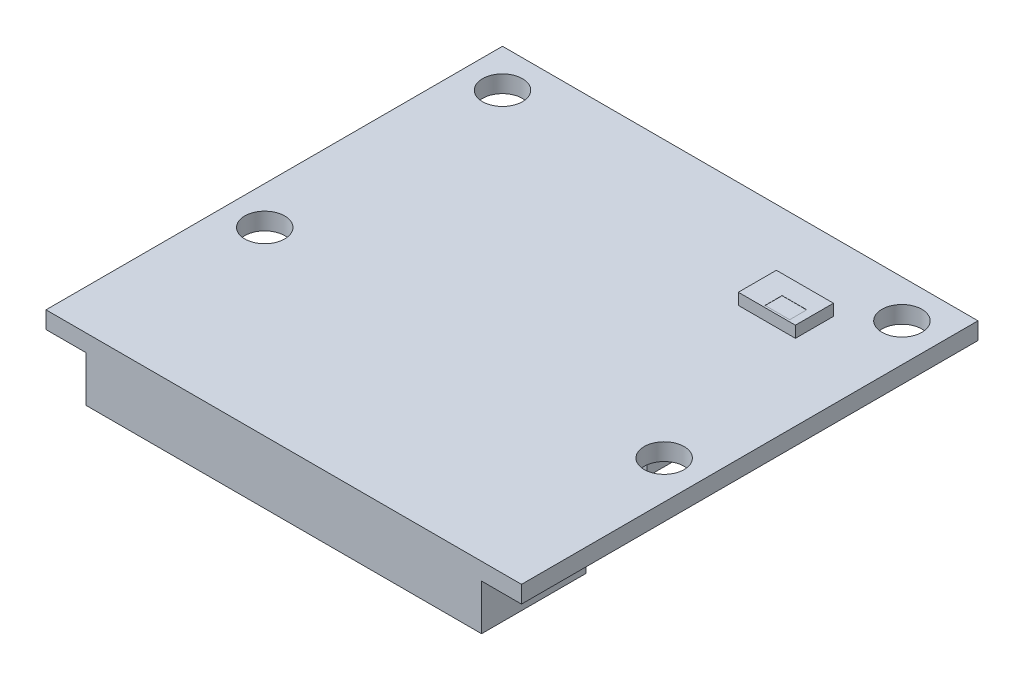
ISO-10303-21;
HEADER;
FILE_DESCRIPTION(('STEP AP214'),'2;1');
FILE_NAME('part.step','',(''),(''),'','','');
FILE_SCHEMA(('AUTOMOTIVE_DESIGN { 1 0 10303 214 1 1 1 1 }'));
ENDSEC;
DATA;
#1=APPLICATION_CONTEXT('core data for automotive mechanical design processes');
#2=APPLICATION_PROTOCOL_DEFINITION('international standard','automotive_design',2000,#1);
#3=PRODUCT_CONTEXT('',#1,'mechanical');
#4=PRODUCT('Part','Part','',(#3));
#5=PRODUCT_RELATED_PRODUCT_CATEGORY('part','',(#4));
#6=PRODUCT_DEFINITION_FORMATION('','',#4);
#7=PRODUCT_DEFINITION_CONTEXT('part definition',#1,'design');
#8=PRODUCT_DEFINITION('design','',#6,#7);
#9=PRODUCT_DEFINITION_SHAPE('','',#8);
#10=(LENGTH_UNIT() NAMED_UNIT(*) SI_UNIT(.MILLI.,.METRE.));
#11=(NAMED_UNIT(*) PLANE_ANGLE_UNIT() SI_UNIT($,.RADIAN.));
#12=(NAMED_UNIT(*) SI_UNIT($,.STERADIAN.) SOLID_ANGLE_UNIT());
#13=UNCERTAINTY_MEASURE_WITH_UNIT(LENGTH_MEASURE(1.E-05),#10,'distance_accuracy_value','');
#14=(GEOMETRIC_REPRESENTATION_CONTEXT(3) GLOBAL_UNCERTAINTY_ASSIGNED_CONTEXT((#13)) GLOBAL_UNIT_ASSIGNED_CONTEXT((#10,
#11,#12)) REPRESENTATION_CONTEXT('',''));
#15=CARTESIAN_POINT('',(0.,0.,0.));
#16=DIRECTION('',(0.,0.,1.));
#17=DIRECTION('',(1.,0.,0.));
#18=AXIS2_PLACEMENT_3D('',#15,#16,#17);
#19=CARTESIAN_POINT('',(0.,0.,0.));
#20=DIRECTION('',(0.,1.,0.));
#21=DIRECTION('',(0.,0.,1.));
#22=AXIS2_PLACEMENT_3D('',#19,#20,#21);
#23=PLANE('',#22);
#24=DIRECTION('',(0.,0.,1.));
#25=VECTOR('',#24,1.);
#26=CARTESIAN_POINT('',(-12.5,0.,-14.5));
#27=LINE('',#26,#25);
#28=CARTESIAN_POINT('',(-12.5,0.,-14.5));
#29=VERTEX_POINT('',#28);
#30=CARTESIAN_POINT('',(-12.5,0.,9.5));
#31=VERTEX_POINT('',#30);
#32=EDGE_CURVE('E327',#29,#31,#27,.T.);
#33=ORIENTED_EDGE('',*,*,#32,.T.);
#34=DIRECTION('',(1.,0.,0.));
#35=VECTOR('',#34,1.);
#36=CARTESIAN_POINT('',(-12.5,0.,9.5));
#37=LINE('',#36,#35);
#38=CARTESIAN_POINT('',(12.5,0.,9.5));
#39=VERTEX_POINT('',#38);
#40=EDGE_CURVE('E330',#31,#39,#37,.T.);
#41=ORIENTED_EDGE('',*,*,#40,.T.);
#42=DIRECTION('',(0.,0.,-1.));
#43=VECTOR('',#42,1.);
#44=CARTESIAN_POINT('',(12.5,0.,-14.5));
#45=LINE('',#44,#43);
#46=CARTESIAN_POINT('',(12.5,0.,-14.5));
#47=VERTEX_POINT('',#46);
#48=EDGE_CURVE('E334',#39,#47,#45,.T.);
#49=ORIENTED_EDGE('',*,*,#48,.T.);
#50=DIRECTION('',(-1.,0.,0.));
#51=VECTOR('',#50,1.);
#52=CARTESIAN_POINT('',(-12.5,0.,-14.5));
#53=LINE('',#52,#51);
#54=EDGE_CURVE('E337',#47,#29,#53,.T.);
#55=ORIENTED_EDGE('',*,*,#54,.T.);
#56=EDGE_LOOP('',(#33,#41,#49,#55));
#57=FACE_BOUND('',#56,.T.);
#58=CARTESIAN_POINT('',(10.5,0.,-12.5));
#59=DIRECTION('',(0.,1.,0.));
#60=DIRECTION('',(0.,0.,1.));
#61=AXIS2_PLACEMENT_3D('',#58,#59,#60);
#62=CIRCLE('',#61,1.05);
#63=CARTESIAN_POINT('',(10.5,0.,-11.45));
#64=VERTEX_POINT('',#63);
#65=EDGE_CURVE('E390',#64,#64,#62,.T.);
#66=ORIENTED_EDGE('',*,*,#65,.F.);
#67=EDGE_LOOP('',(#66));
#68=FACE_BOUND('',#67,.T.);
#69=CARTESIAN_POINT('',(10.5,0.,0.));
#70=DIRECTION('',(0.,1.,0.));
#71=DIRECTION('',(0.,0.,1.));
#72=AXIS2_PLACEMENT_3D('',#69,#70,#71);
#73=CIRCLE('',#72,1.05);
#74=CARTESIAN_POINT('',(10.5,0.,1.05));
#75=VERTEX_POINT('',#74);
#76=EDGE_CURVE('E384',#75,#75,#73,.T.);
#77=ORIENTED_EDGE('',*,*,#76,.F.);
#78=EDGE_LOOP('',(#77));
#79=FACE_BOUND('',#78,.T.);
#80=CARTESIAN_POINT('',(-10.5,0.,0.));
#81=DIRECTION('',(0.,1.,0.));
#82=DIRECTION('',(0.,0.,-1.));
#83=AXIS2_PLACEMENT_3D('',#80,#81,#82);
#84=CIRCLE('',#83,1.05);
#85=CARTESIAN_POINT('',(-10.5,0.,-1.05));
#86=VERTEX_POINT('',#85);
#87=EDGE_CURVE('E379',#86,#86,#84,.T.);
#88=ORIENTED_EDGE('',*,*,#87,.F.);
#89=EDGE_LOOP('',(#88));
#90=FACE_BOUND('',#89,.T.);
#91=CARTESIAN_POINT('',(-10.5,0.,-12.5));
#92=DIRECTION('',(0.,1.,0.));
#93=DIRECTION('',(0.,0.,-1.));
#94=AXIS2_PLACEMENT_3D('',#91,#92,#93);
#95=CIRCLE('',#94,1.05);
#96=CARTESIAN_POINT('',(-10.5,0.,-13.55));
#97=VERTEX_POINT('',#96);
#98=EDGE_CURVE('E373',#97,#97,#95,.T.);
#99=ORIENTED_EDGE('',*,*,#98,.F.);
#100=EDGE_LOOP('',(#99));
#101=FACE_BOUND('',#100,.T.);
#102=DIRECTION('',(1.,0.,0.));
#103=VECTOR('',#102,1.);
#104=CARTESIAN_POINT('',(5.5,0.,-8.90000000000001));
#105=LINE('',#104,#103);
#106=CARTESIAN_POINT('',(5.5,0.,-8.90000000000001));
#107=VERTEX_POINT('',#106);
#108=CARTESIAN_POINT('',(8.5,0.,-8.90000000000001));
#109=VERTEX_POINT('',#108);
#110=EDGE_CURVE('E223',#107,#109,#105,.T.);
#111=ORIENTED_EDGE('',*,*,#110,.F.);
#112=DIRECTION('',(0.,0.,1.));
#113=VECTOR('',#112,1.);
#114=CARTESIAN_POINT('',(5.5,0.,-10.9));
#115=LINE('',#114,#113);
#116=CARTESIAN_POINT('',(5.5,0.,-10.9));
#117=VERTEX_POINT('',#116);
#118=EDGE_CURVE('E206',#117,#107,#115,.T.);
#119=ORIENTED_EDGE('',*,*,#118,.F.);
#120=DIRECTION('',(-1.,0.,0.));
#121=VECTOR('',#120,1.);
#122=CARTESIAN_POINT('',(5.5,0.,-10.9));
#123=LINE('',#122,#121);
#124=CARTESIAN_POINT('',(8.5,0.,-10.9));
#125=VERTEX_POINT('',#124);
#126=EDGE_CURVE('E214',#125,#117,#123,.T.);
#127=ORIENTED_EDGE('',*,*,#126,.F.);
#128=DIRECTION('',(0.,0.,-1.));
#129=VECTOR('',#128,1.);
#130=CARTESIAN_POINT('',(8.5,0.,-10.9));
#131=LINE('',#130,#129);
#132=EDGE_CURVE('E225',#109,#125,#131,.T.);
#133=ORIENTED_EDGE('',*,*,#132,.F.);
#134=EDGE_LOOP('',(#111,#119,#127,#133));
#135=FACE_BOUND('',#134,.T.);
#136=ADVANCED_FACE('F32',(#57,#68,#79,#90,#101,#135),#23,.T.);
#137=CARTESIAN_POINT('',(0.,-0.9,0.));
#138=DIRECTION('',(0.,1.,0.));
#139=DIRECTION('',(0.,0.,1.));
#140=AXIS2_PLACEMENT_3D('',#137,#138,#139);
#141=PLANE('',#140);
#142=DIRECTION('',(0.,0.,-1.));
#143=VECTOR('',#142,1.);
#144=CARTESIAN_POINT('',(-10.4,-0.9,9.5));
#145=LINE('',#144,#143);
#146=CARTESIAN_POINT('',(-10.4,-0.9,9.5));
#147=VERTEX_POINT('',#146);
#148=CARTESIAN_POINT('',(-10.4,-0.9,4.));
#149=VERTEX_POINT('',#148);
#150=EDGE_CURVE('E269',#147,#149,#145,.T.);
#151=ORIENTED_EDGE('',*,*,#150,.F.);
#152=DIRECTION('',(1.,0.,0.));
#153=VECTOR('',#152,1.);
#154=CARTESIAN_POINT('',(-12.5,-0.9,9.5));
#155=LINE('',#154,#153);
#156=CARTESIAN_POINT('',(-12.5,-0.9,9.5));
#157=VERTEX_POINT('',#156);
#158=EDGE_CURVE('E312',#157,#147,#155,.T.);
#159=ORIENTED_EDGE('',*,*,#158,.F.);
#160=DIRECTION('',(0.,0.,1.));
#161=VECTOR('',#160,1.);
#162=CARTESIAN_POINT('',(-12.5,-0.9,-14.5));
#163=LINE('',#162,#161);
#164=CARTESIAN_POINT('',(-12.5,-0.9,-14.5));
#165=VERTEX_POINT('',#164);
#166=EDGE_CURVE('E313',#165,#157,#163,.T.);
#167=ORIENTED_EDGE('',*,*,#166,.F.);
#168=DIRECTION('',(-1.,0.,0.));
#169=VECTOR('',#168,1.);
#170=CARTESIAN_POINT('',(-12.5,-0.9,-14.5));
#171=LINE('',#170,#169);
#172=CARTESIAN_POINT('',(12.5,-0.9,-14.5));
#173=VERTEX_POINT('',#172);
#174=EDGE_CURVE('E323',#173,#165,#171,.T.);
#175=ORIENTED_EDGE('',*,*,#174,.F.);
#176=DIRECTION('',(0.,0.,-1.));
#177=VECTOR('',#176,1.);
#178=CARTESIAN_POINT('',(12.5,-0.9,-14.5));
#179=LINE('',#178,#177);
#180=CARTESIAN_POINT('',(12.5,-0.9,9.5));
#181=VERTEX_POINT('',#180);
#182=EDGE_CURVE('E319',#181,#173,#179,.T.);
#183=ORIENTED_EDGE('',*,*,#182,.F.);
#184=CARTESIAN_POINT('',(10.4,-0.9,9.5));
#185=VERTEX_POINT('',#184);
#186=EDGE_CURVE('E309',#185,#181,#155,.T.);
#187=ORIENTED_EDGE('',*,*,#186,.F.);
#188=DIRECTION('',(0.,0.,1.));
#189=VECTOR('',#188,1.);
#190=CARTESIAN_POINT('',(10.4,-0.9,9.5));
#191=LINE('',#190,#189);
#192=CARTESIAN_POINT('',(10.4,-0.9,4.));
#193=VERTEX_POINT('',#192);
#194=EDGE_CURVE('E274',#193,#185,#191,.T.);
#195=ORIENTED_EDGE('',*,*,#194,.F.);
#196=DIRECTION('',(1.,0.,0.));
#197=VECTOR('',#196,1.);
#198=CARTESIAN_POINT('',(-10.4,-0.9,4.));
#199=LINE('',#198,#197);
#200=EDGE_CURVE('E281',#149,#193,#199,.T.);
#201=ORIENTED_EDGE('',*,*,#200,.F.);
#202=EDGE_LOOP('',(#151,#159,#167,#175,#183,#187,#195,#201));
#203=FACE_BOUND('',#202,.T.);
#204=CARTESIAN_POINT('',(-10.5,-0.9,-12.5));
#205=DIRECTION('',(0.,1.,0.));
#206=DIRECTION('',(0.,0.,-1.));
#207=AXIS2_PLACEMENT_3D('',#204,#205,#206);
#208=CIRCLE('',#207,1.05);
#209=CARTESIAN_POINT('',(-10.5,-0.9,-13.55));
#210=VERTEX_POINT('',#209);
#211=EDGE_CURVE('E375',#210,#210,#208,.T.);
#212=ORIENTED_EDGE('',*,*,#211,.T.);
#213=EDGE_LOOP('',(#212));
#214=FACE_BOUND('',#213,.T.);
#215=CARTESIAN_POINT('',(-10.5,-0.9,0.));
#216=DIRECTION('',(0.,1.,0.));
#217=DIRECTION('',(0.,0.,-1.));
#218=AXIS2_PLACEMENT_3D('',#215,#216,#217);
#219=CIRCLE('',#218,1.05);
#220=CARTESIAN_POINT('',(-10.5,-0.9,-1.05));
#221=VERTEX_POINT('',#220);
#222=EDGE_CURVE('E381',#221,#221,#219,.T.);
#223=ORIENTED_EDGE('',*,*,#222,.T.);
#224=EDGE_LOOP('',(#223));
#225=FACE_BOUND('',#224,.T.);
#226=CARTESIAN_POINT('',(10.5,-0.9,0.));
#227=DIRECTION('',(0.,1.,0.));
#228=DIRECTION('',(0.,0.,1.));
#229=AXIS2_PLACEMENT_3D('',#226,#227,#228);
#230=CIRCLE('',#229,1.05);
#231=CARTESIAN_POINT('',(10.5,-0.9,1.05));
#232=VERTEX_POINT('',#231);
#233=EDGE_CURVE('E387',#232,#232,#230,.T.);
#234=ORIENTED_EDGE('',*,*,#233,.T.);
#235=EDGE_LOOP('',(#234));
#236=FACE_BOUND('',#235,.T.);
#237=CARTESIAN_POINT('',(10.5,-0.9,-12.5));
#238=DIRECTION('',(0.,1.,0.));
#239=DIRECTION('',(0.,0.,1.));
#240=AXIS2_PLACEMENT_3D('',#237,#238,#239);
#241=CIRCLE('',#240,1.05);
#242=CARTESIAN_POINT('',(10.5,-0.9,-11.45));
#243=VERTEX_POINT('',#242);
#244=EDGE_CURVE('E331',#243,#243,#241,.T.);
#245=ORIENTED_EDGE('',*,*,#244,.T.);
#246=EDGE_LOOP('',(#245));
#247=FACE_BOUND('',#246,.T.);
#248=DIRECTION('',(0.,0.,-1.));
#249=VECTOR('',#248,1.);
#250=CARTESIAN_POINT('',(-9.,-0.9,-0.900000000000005));
#251=LINE('',#250,#249);
#252=CARTESIAN_POINT('',(-9.,-0.9,-0.900000000000005));
#253=VERTEX_POINT('',#252);
#254=CARTESIAN_POINT('',(-9.,-0.9,-12.5));
#255=VERTEX_POINT('',#254);
#256=EDGE_CURVE('E236',#253,#255,#251,.T.);
#257=ORIENTED_EDGE('',*,*,#256,.F.);
#258=DIRECTION('',(-1.,0.,0.));
#259=VECTOR('',#258,1.);
#260=CARTESIAN_POINT('',(-9.,-0.9,-0.900000000000005));
#261=LINE('',#260,#259);
#262=CARTESIAN_POINT('',(8.7,-0.9,-0.900000000000005));
#263=VERTEX_POINT('',#262);
#264=EDGE_CURVE('E241',#263,#253,#261,.T.);
#265=ORIENTED_EDGE('',*,*,#264,.F.);
#266=DIRECTION('',(0.,0.,1.));
#267=VECTOR('',#266,1.);
#268=CARTESIAN_POINT('',(8.7,-0.9,-0.900000000000005));
#269=LINE('',#268,#267);
#270=CARTESIAN_POINT('',(8.7,-0.9,-12.5));
#271=VERTEX_POINT('',#270);
#272=EDGE_CURVE('E253',#271,#263,#269,.T.);
#273=ORIENTED_EDGE('',*,*,#272,.F.);
#274=DIRECTION('',(1.,0.,0.));
#275=VECTOR('',#274,1.);
#276=CARTESIAN_POINT('',(-9.,-0.9,-12.5));
#277=LINE('',#276,#275);
#278=EDGE_CURVE('E250',#255,#271,#277,.T.);
#279=ORIENTED_EDGE('',*,*,#278,.F.);
#280=EDGE_LOOP('',(#257,#265,#273,#279));
#281=FACE_BOUND('',#280,.T.);
#282=ADVANCED_FACE('F359',(#203,#214,#225,#236,#247,#281),#141,.F.);
#283=CARTESIAN_POINT('',(-12.5,-0.9,-14.5));
#284=DIRECTION('',(-1.,0.,0.));
#285=DIRECTION('',(0.,0.,1.));
#286=AXIS2_PLACEMENT_3D('',#283,#284,#285);
#287=PLANE('',#286);
#288=ORIENTED_EDGE('',*,*,#32,.F.);
#289=DIRECTION('',(0.,1.,0.));
#290=VECTOR('',#289,1.);
#291=CARTESIAN_POINT('',(-12.5,-0.9,-14.5));
#292=LINE('',#291,#290);
#293=EDGE_CURVE('E11',#165,#29,#292,.T.);
#294=ORIENTED_EDGE('',*,*,#293,.F.);
#295=ORIENTED_EDGE('',*,*,#166,.T.);
#296=DIRECTION('',(0.,1.,0.));
#297=VECTOR('',#296,1.);
#298=CARTESIAN_POINT('',(-12.5,-0.9,9.5));
#299=LINE('',#298,#297);
#300=EDGE_CURVE('E326',#157,#31,#299,.T.);
#301=ORIENTED_EDGE('',*,*,#300,.T.);
#302=EDGE_LOOP('',(#288,#294,#295,#301));
#303=FACE_BOUND('',#302,.T.);
#304=ADVANCED_FACE('F34',(#303),#287,.T.);
#305=CARTESIAN_POINT('',(-12.5,-0.9,-14.5));
#306=DIRECTION('',(0.,0.,-1.));
#307=DIRECTION('',(-1.,0.,0.));
#308=AXIS2_PLACEMENT_3D('',#305,#306,#307);
#309=PLANE('',#308);
#310=ORIENTED_EDGE('',*,*,#54,.F.);
#311=DIRECTION('',(0.,1.,0.));
#312=VECTOR('',#311,1.);
#313=CARTESIAN_POINT('',(12.5,-0.9,-14.5));
#314=LINE('',#313,#312);
#315=EDGE_CURVE('E41',#173,#47,#314,.T.);
#316=ORIENTED_EDGE('',*,*,#315,.F.);
#317=ORIENTED_EDGE('',*,*,#174,.T.);
#318=ORIENTED_EDGE('',*,*,#293,.T.);
#319=EDGE_LOOP('',(#310,#316,#317,#318));
#320=FACE_BOUND('',#319,.T.);
#321=ADVANCED_FACE('F356',(#320),#309,.T.);
#322=CARTESIAN_POINT('',(12.5,-0.9,-14.5));
#323=DIRECTION('',(1.,0.,0.));
#324=DIRECTION('',(0.,0.,-1.));
#325=AXIS2_PLACEMENT_3D('',#322,#323,#324);
#326=PLANE('',#325);
#327=ORIENTED_EDGE('',*,*,#48,.F.);
#328=DIRECTION('',(0.,1.,0.));
#329=VECTOR('',#328,1.);
#330=CARTESIAN_POINT('',(12.5,-0.9,9.5));
#331=LINE('',#330,#329);
#332=EDGE_CURVE('E341',#181,#39,#331,.T.);
#333=ORIENTED_EDGE('',*,*,#332,.F.);
#334=ORIENTED_EDGE('',*,*,#182,.T.);
#335=ORIENTED_EDGE('',*,*,#315,.T.);
#336=EDGE_LOOP('',(#327,#333,#334,#335));
#337=FACE_BOUND('',#336,.T.);
#338=ADVANCED_FACE('F487',(#337),#326,.T.);
#339=CARTESIAN_POINT('',(-12.5,-0.9,9.5));
#340=DIRECTION('',(0.,0.,1.));
#341=DIRECTION('',(1.,0.,0.));
#342=AXIS2_PLACEMENT_3D('',#339,#340,#341);
#343=PLANE('',#342);
#344=ORIENTED_EDGE('',*,*,#40,.F.);
#345=ORIENTED_EDGE('',*,*,#300,.F.);
#346=ORIENTED_EDGE('',*,*,#158,.T.);
#347=DIRECTION('',(0.,1.,0.));
#348=VECTOR('',#347,1.);
#349=CARTESIAN_POINT('',(-10.4,-3.3,9.5));
#350=LINE('',#349,#348);
#351=CARTESIAN_POINT('',(-10.4,-3.3,9.5));
#352=VERTEX_POINT('',#351);
#353=EDGE_CURVE('E280',#352,#147,#350,.T.);
#354=ORIENTED_EDGE('',*,*,#353,.F.);
#355=DIRECTION('',(-1.,0.,0.));
#356=VECTOR('',#355,1.);
#357=CARTESIAN_POINT('',(-10.4,-3.3,9.5));
#358=LINE('',#357,#356);
#359=CARTESIAN_POINT('',(10.4,-3.3,9.5));
#360=VERTEX_POINT('',#359);
#361=EDGE_CURVE('E278',#360,#352,#358,.T.);
#362=ORIENTED_EDGE('',*,*,#361,.F.);
#363=DIRECTION('',(0.,1.,0.));
#364=VECTOR('',#363,1.);
#365=CARTESIAN_POINT('',(10.4,-3.3,9.5));
#366=LINE('',#365,#364);
#367=EDGE_CURVE('E293',#360,#185,#366,.T.);
#368=ORIENTED_EDGE('',*,*,#367,.T.);
#369=ORIENTED_EDGE('',*,*,#186,.T.);
#370=ORIENTED_EDGE('',*,*,#332,.T.);
#371=EDGE_LOOP('',(#344,#345,#346,#354,#362,#368,#369,#370));
#372=FACE_BOUND('',#371,.T.);
#373=ADVANCED_FACE('F349',(#372),#343,.T.);
#374=CARTESIAN_POINT('',(10.5,-0.9,-12.5));
#375=DIRECTION('',(0.,1.,0.));
#376=DIRECTION('',(0.,0.,1.));
#377=AXIS2_PLACEMENT_3D('',#374,#375,#376);
#378=CYLINDRICAL_SURFACE('',#377,1.05);
#379=ORIENTED_EDGE('',*,*,#244,.F.);
#380=EDGE_LOOP('',(#379));
#381=FACE_BOUND('',#380,.T.);
#382=ORIENTED_EDGE('',*,*,#65,.T.);
#383=EDGE_LOOP('',(#382));
#384=FACE_BOUND('',#383,.T.);
#385=ADVANCED_FACE('F397',(#381,#384),#378,.F.);
#386=CARTESIAN_POINT('',(10.5,-0.9,0.));
#387=DIRECTION('',(0.,1.,0.));
#388=DIRECTION('',(0.,0.,1.));
#389=AXIS2_PLACEMENT_3D('',#386,#387,#388);
#390=CYLINDRICAL_SURFACE('',#389,1.05);
#391=ORIENTED_EDGE('',*,*,#233,.F.);
#392=EDGE_LOOP('',(#391));
#393=FACE_BOUND('',#392,.T.);
#394=ORIENTED_EDGE('',*,*,#76,.T.);
#395=EDGE_LOOP('',(#394));
#396=FACE_BOUND('',#395,.T.);
#397=ADVANCED_FACE('F475',(#393,#396),#390,.F.);
#398=CARTESIAN_POINT('',(-10.5,-0.9,0.));
#399=DIRECTION('',(0.,1.,0.));
#400=DIRECTION('',(0.,0.,1.));
#401=AXIS2_PLACEMENT_3D('',#398,#399,#400);
#402=CYLINDRICAL_SURFACE('',#401,1.05);
#403=ORIENTED_EDGE('',*,*,#222,.F.);
#404=EDGE_LOOP('',(#403));
#405=FACE_BOUND('',#404,.T.);
#406=ORIENTED_EDGE('',*,*,#87,.T.);
#407=EDGE_LOOP('',(#406));
#408=FACE_BOUND('',#407,.T.);
#409=ADVANCED_FACE('F471',(#405,#408),#402,.F.);
#410=CARTESIAN_POINT('',(-10.5,-0.9,-12.5));
#411=DIRECTION('',(0.,1.,0.));
#412=DIRECTION('',(0.,0.,1.));
#413=AXIS2_PLACEMENT_3D('',#410,#411,#412);
#414=CYLINDRICAL_SURFACE('',#413,1.05);
#415=ORIENTED_EDGE('',*,*,#211,.F.);
#416=EDGE_LOOP('',(#415));
#417=FACE_BOUND('',#416,.T.);
#418=ORIENTED_EDGE('',*,*,#98,.T.);
#419=EDGE_LOOP('',(#418));
#420=FACE_BOUND('',#419,.T.);
#421=ADVANCED_FACE('F468',(#417,#420),#414,.F.);
#422=CARTESIAN_POINT('',(-10.4,-3.3,9.5));
#423=DIRECTION('',(1.,0.,0.));
#424=DIRECTION('',(0.,0.,-1.));
#425=AXIS2_PLACEMENT_3D('',#422,#423,#424);
#426=PLANE('',#425);
#427=ORIENTED_EDGE('',*,*,#150,.T.);
#428=DIRECTION('',(0.,1.,0.));
#429=VECTOR('',#428,1.);
#430=CARTESIAN_POINT('',(-10.4,-3.3,4.));
#431=LINE('',#430,#429);
#432=CARTESIAN_POINT('',(-10.4,-3.3,4.));
#433=VERTEX_POINT('',#432);
#434=EDGE_CURVE('E299',#433,#149,#431,.T.);
#435=ORIENTED_EDGE('',*,*,#434,.F.);
#436=DIRECTION('',(0.,0.,-1.));
#437=VECTOR('',#436,1.);
#438=CARTESIAN_POINT('',(-10.4,-3.3,9.5));
#439=LINE('',#438,#437);
#440=EDGE_CURVE('E270',#352,#433,#439,.T.);
#441=ORIENTED_EDGE('',*,*,#440,.F.);
#442=ORIENTED_EDGE('',*,*,#353,.T.);
#443=EDGE_LOOP('',(#427,#435,#441,#442));
#444=FACE_BOUND('',#443,.T.);
#445=ADVANCED_FACE('F363',(#444),#426,.F.);
#446=CARTESIAN_POINT('',(-10.4,-3.3,4.));
#447=DIRECTION('',(0.,0.,1.));
#448=DIRECTION('',(1.,0.,0.));
#449=AXIS2_PLACEMENT_3D('',#446,#447,#448);
#450=PLANE('',#449);
#451=ORIENTED_EDGE('',*,*,#200,.T.);
#452=DIRECTION('',(0.,1.,0.));
#453=VECTOR('',#452,1.);
#454=CARTESIAN_POINT('',(10.4,-3.3,4.));
#455=LINE('',#454,#453);
#456=CARTESIAN_POINT('',(10.4,-3.3,4.));
#457=VERTEX_POINT('',#456);
#458=EDGE_CURVE('E286',#457,#193,#455,.T.);
#459=ORIENTED_EDGE('',*,*,#458,.F.);
#460=DIRECTION('',(1.,0.,0.));
#461=VECTOR('',#460,1.);
#462=CARTESIAN_POINT('',(-10.4,-3.3,4.));
#463=LINE('',#462,#461);
#464=EDGE_CURVE('E273',#433,#457,#463,.T.);
#465=ORIENTED_EDGE('',*,*,#464,.F.);
#466=ORIENTED_EDGE('',*,*,#434,.T.);
#467=EDGE_LOOP('',(#451,#459,#465,#466));
#468=FACE_BOUND('',#467,.T.);
#469=ADVANCED_FACE('F372',(#468),#450,.F.);
#470=CARTESIAN_POINT('',(10.4,-3.3,9.5));
#471=DIRECTION('',(-1.,0.,0.));
#472=DIRECTION('',(0.,0.,1.));
#473=AXIS2_PLACEMENT_3D('',#470,#471,#472);
#474=PLANE('',#473);
#475=ORIENTED_EDGE('',*,*,#194,.T.);
#476=ORIENTED_EDGE('',*,*,#367,.F.);
#477=DIRECTION('',(0.,0.,1.));
#478=VECTOR('',#477,1.);
#479=CARTESIAN_POINT('',(10.4,-3.3,9.5));
#480=LINE('',#479,#478);
#481=EDGE_CURVE('E276',#457,#360,#480,.T.);
#482=ORIENTED_EDGE('',*,*,#481,.F.);
#483=ORIENTED_EDGE('',*,*,#458,.T.);
#484=EDGE_LOOP('',(#475,#476,#482,#483));
#485=FACE_BOUND('',#484,.T.);
#486=ADVANCED_FACE('F370',(#485),#474,.F.);
#487=CARTESIAN_POINT('',(0.,-3.3,0.));
#488=DIRECTION('',(0.,-1.,0.));
#489=DIRECTION('',(0.,0.,-1.));
#490=AXIS2_PLACEMENT_3D('',#487,#488,#489);
#491=PLANE('',#490);
#492=ORIENTED_EDGE('',*,*,#440,.T.);
#493=ORIENTED_EDGE('',*,*,#464,.T.);
#494=ORIENTED_EDGE('',*,*,#481,.T.);
#495=ORIENTED_EDGE('',*,*,#361,.T.);
#496=EDGE_LOOP('',(#492,#493,#494,#495));
#497=FACE_BOUND('',#496,.T.);
#498=ADVANCED_FACE('F366',(#497),#491,.T.);
#499=CARTESIAN_POINT('',(-9.,-2.2,-0.900000000000005));
#500=DIRECTION('',(1.,0.,0.));
#501=DIRECTION('',(0.,0.,-1.));
#502=AXIS2_PLACEMENT_3D('',#499,#500,#501);
#503=PLANE('',#502);
#504=ORIENTED_EDGE('',*,*,#256,.T.);
#505=DIRECTION('',(0.,1.,0.));
#506=VECTOR('',#505,1.);
#507=CARTESIAN_POINT('',(-9.,-2.2,-12.5));
#508=LINE('',#507,#506);
#509=CARTESIAN_POINT('',(-9.,-2.2,-12.5));
#510=VERTEX_POINT('',#509);
#511=EDGE_CURVE('E266',#510,#255,#508,.T.);
#512=ORIENTED_EDGE('',*,*,#511,.F.);
#513=DIRECTION('',(0.,0.,-1.));
#514=VECTOR('',#513,1.);
#515=CARTESIAN_POINT('',(-9.,-2.2,-0.900000000000005));
#516=LINE('',#515,#514);
#517=CARTESIAN_POINT('',(-9.,-2.2,-0.900000000000005));
#518=VERTEX_POINT('',#517);
#519=EDGE_CURVE('E237',#518,#510,#516,.T.);
#520=ORIENTED_EDGE('',*,*,#519,.F.);
#521=DIRECTION('',(0.,1.,0.));
#522=VECTOR('',#521,1.);
#523=CARTESIAN_POINT('',(-9.,-2.2,-0.900000000000005));
#524=LINE('',#523,#522);
#525=EDGE_CURVE('E247',#518,#253,#524,.T.);
#526=ORIENTED_EDGE('',*,*,#525,.T.);
#527=EDGE_LOOP('',(#504,#512,#520,#526));
#528=FACE_BOUND('',#527,.T.);
#529=ADVANCED_FACE('F455',(#528),#503,.F.);
#530=CARTESIAN_POINT('',(-9.,-2.2,-12.5));
#531=DIRECTION('',(0.,0.,1.));
#532=DIRECTION('',(1.,0.,0.));
#533=AXIS2_PLACEMENT_3D('',#530,#531,#532);
#534=PLANE('',#533);
#535=ORIENTED_EDGE('',*,*,#278,.T.);
#536=DIRECTION('',(0.,1.,0.));
#537=VECTOR('',#536,1.);
#538=CARTESIAN_POINT('',(8.7,-2.2,-12.5));
#539=LINE('',#538,#537);
#540=CARTESIAN_POINT('',(8.7,-2.2,-12.5));
#541=VERTEX_POINT('',#540);
#542=EDGE_CURVE('E263',#541,#271,#539,.T.);
#543=ORIENTED_EDGE('',*,*,#542,.F.);
#544=DIRECTION('',(1.,0.,0.));
#545=VECTOR('',#544,1.);
#546=CARTESIAN_POINT('',(-9.,-2.2,-12.5));
#547=LINE('',#546,#545);
#548=EDGE_CURVE('E240',#510,#541,#547,.T.);
#549=ORIENTED_EDGE('',*,*,#548,.F.);
#550=ORIENTED_EDGE('',*,*,#511,.T.);
#551=EDGE_LOOP('',(#535,#543,#549,#550));
#552=FACE_BOUND('',#551,.T.);
#553=ADVANCED_FACE('F451',(#552),#534,.F.);
#554=CARTESIAN_POINT('',(8.7,-2.2,-0.900000000000005));
#555=DIRECTION('',(-1.,0.,0.));
#556=DIRECTION('',(0.,0.,1.));
#557=AXIS2_PLACEMENT_3D('',#554,#555,#556);
#558=PLANE('',#557);
#559=ORIENTED_EDGE('',*,*,#272,.T.);
#560=DIRECTION('',(0.,1.,0.));
#561=VECTOR('',#560,1.);
#562=CARTESIAN_POINT('',(8.7,-2.2,-0.900000000000005));
#563=LINE('',#562,#561);
#564=CARTESIAN_POINT('',(8.7,-2.2,-0.900000000000005));
#565=VERTEX_POINT('',#564);
#566=EDGE_CURVE('E260',#565,#263,#563,.T.);
#567=ORIENTED_EDGE('',*,*,#566,.F.);
#568=DIRECTION('',(0.,0.,1.));
#569=VECTOR('',#568,1.);
#570=CARTESIAN_POINT('',(8.7,-2.2,-0.900000000000005));
#571=LINE('',#570,#569);
#572=EDGE_CURVE('E243',#541,#565,#571,.T.);
#573=ORIENTED_EDGE('',*,*,#572,.F.);
#574=ORIENTED_EDGE('',*,*,#542,.T.);
#575=EDGE_LOOP('',(#559,#567,#573,#574));
#576=FACE_BOUND('',#575,.T.);
#577=ADVANCED_FACE('F447',(#576),#558,.F.);
#578=CARTESIAN_POINT('',(-9.,-2.2,-0.900000000000005));
#579=DIRECTION('',(0.,0.,-1.));
#580=DIRECTION('',(-1.,0.,0.));
#581=AXIS2_PLACEMENT_3D('',#578,#579,#580);
#582=PLANE('',#581);
#583=ORIENTED_EDGE('',*,*,#264,.T.);
#584=ORIENTED_EDGE('',*,*,#525,.F.);
#585=DIRECTION('',(-1.,0.,0.));
#586=VECTOR('',#585,1.);
#587=CARTESIAN_POINT('',(-9.,-2.2,-0.900000000000005));
#588=LINE('',#587,#586);
#589=EDGE_CURVE('E245',#565,#518,#588,.T.);
#590=ORIENTED_EDGE('',*,*,#589,.F.);
#591=ORIENTED_EDGE('',*,*,#566,.T.);
#592=EDGE_LOOP('',(#583,#584,#590,#591));
#593=FACE_BOUND('',#592,.T.);
#594=ADVANCED_FACE('F443',(#593),#582,.F.);
#595=CARTESIAN_POINT('',(0.,-2.2,0.));
#596=DIRECTION('',(0.,-1.,0.));
#597=DIRECTION('',(0.,0.,-1.));
#598=AXIS2_PLACEMENT_3D('',#595,#596,#597);
#599=PLANE('',#598);
#600=ORIENTED_EDGE('',*,*,#519,.T.);
#601=ORIENTED_EDGE('',*,*,#548,.T.);
#602=ORIENTED_EDGE('',*,*,#572,.T.);
#603=ORIENTED_EDGE('',*,*,#589,.T.);
#604=EDGE_LOOP('',(#600,#601,#602,#603));
#605=FACE_BOUND('',#604,.T.);
#606=ADVANCED_FACE('F440',(#605),#599,.T.);
#607=CARTESIAN_POINT('',(5.5,0.6,-10.9));
#608=DIRECTION('',(1.,0.,0.));
#609=DIRECTION('',(0.,0.,-1.));
#610=AXIS2_PLACEMENT_3D('',#607,#608,#609);
#611=PLANE('',#610);
#612=ORIENTED_EDGE('',*,*,#118,.T.);
#613=DIRECTION('',(0.,-1.,0.));
#614=VECTOR('',#613,1.);
#615=CARTESIAN_POINT('',(5.5,0.6,-8.90000000000001));
#616=LINE('',#615,#614);
#617=CARTESIAN_POINT('',(5.5,0.6,-8.90000000000001));
#618=VERTEX_POINT('',#617);
#619=EDGE_CURVE('E234',#618,#107,#616,.T.);
#620=ORIENTED_EDGE('',*,*,#619,.F.);
#621=DIRECTION('',(0.,0.,1.));
#622=VECTOR('',#621,1.);
#623=CARTESIAN_POINT('',(5.5,0.6,-10.9));
#624=LINE('',#623,#622);
#625=CARTESIAN_POINT('',(5.5,0.6,-10.9));
#626=VERTEX_POINT('',#625);
#627=EDGE_CURVE('E210',#626,#618,#624,.T.);
#628=ORIENTED_EDGE('',*,*,#627,.F.);
#629=DIRECTION('',(0.,-1.,0.));
#630=VECTOR('',#629,1.);
#631=CARTESIAN_POINT('',(5.5,0.6,-10.9));
#632=LINE('',#631,#630);
#633=EDGE_CURVE('E220',#626,#117,#632,.T.);
#634=ORIENTED_EDGE('',*,*,#633,.T.);
#635=EDGE_LOOP('',(#612,#620,#628,#634));
#636=FACE_BOUND('',#635,.T.);
#637=ADVANCED_FACE('F423',(#636),#611,.F.);
#638=CARTESIAN_POINT('',(5.5,0.6,-8.90000000000001));
#639=DIRECTION('',(0.,0.,-1.));
#640=DIRECTION('',(-1.,0.,0.));
#641=AXIS2_PLACEMENT_3D('',#638,#639,#640);
#642=PLANE('',#641);
#643=ORIENTED_EDGE('',*,*,#110,.T.);
#644=DIRECTION('',(0.,-1.,0.));
#645=VECTOR('',#644,1.);
#646=CARTESIAN_POINT('',(8.5,0.6,-8.90000000000001));
#647=LINE('',#646,#645);
#648=CARTESIAN_POINT('',(8.5,0.6,-8.90000000000001));
#649=VERTEX_POINT('',#648);
#650=EDGE_CURVE('E231',#649,#109,#647,.T.);
#651=ORIENTED_EDGE('',*,*,#650,.F.);
#652=DIRECTION('',(1.,0.,0.));
#653=VECTOR('',#652,1.);
#654=CARTESIAN_POINT('',(5.5,0.6,-8.90000000000001));
#655=LINE('',#654,#653);
#656=EDGE_CURVE('E213',#618,#649,#655,.T.);
#657=ORIENTED_EDGE('',*,*,#656,.F.);
#658=ORIENTED_EDGE('',*,*,#619,.T.);
#659=EDGE_LOOP('',(#643,#651,#657,#658));
#660=FACE_BOUND('',#659,.T.);
#661=ADVANCED_FACE('F413',(#660),#642,.F.);
#662=CARTESIAN_POINT('',(8.5,0.6,-10.9));
#663=DIRECTION('',(-1.,0.,0.));
#664=DIRECTION('',(0.,0.,1.));
#665=AXIS2_PLACEMENT_3D('',#662,#663,#664);
#666=PLANE('',#665);
#667=ORIENTED_EDGE('',*,*,#132,.T.);
#668=DIRECTION('',(0.,-1.,0.));
#669=VECTOR('',#668,1.);
#670=CARTESIAN_POINT('',(8.5,0.6,-10.9));
#671=LINE('',#670,#669);
#672=CARTESIAN_POINT('',(8.5,0.6,-10.9));
#673=VERTEX_POINT('',#672);
#674=EDGE_CURVE('E57',#673,#125,#671,.T.);
#675=ORIENTED_EDGE('',*,*,#674,.F.);
#676=DIRECTION('',(0.,0.,-1.));
#677=VECTOR('',#676,1.);
#678=CARTESIAN_POINT('',(8.5,0.6,-10.9));
#679=LINE('',#678,#677);
#680=EDGE_CURVE('E216',#649,#673,#679,.T.);
#681=ORIENTED_EDGE('',*,*,#680,.F.);
#682=ORIENTED_EDGE('',*,*,#650,.T.);
#683=EDGE_LOOP('',(#667,#675,#681,#682));
#684=FACE_BOUND('',#683,.T.);
#685=ADVANCED_FACE('F417',(#684),#666,.F.);
#686=CARTESIAN_POINT('',(5.5,0.6,-10.9));
#687=DIRECTION('',(0.,0.,1.));
#688=DIRECTION('',(1.,0.,0.));
#689=AXIS2_PLACEMENT_3D('',#686,#687,#688);
#690=PLANE('',#689);
#691=ORIENTED_EDGE('',*,*,#126,.T.);
#692=ORIENTED_EDGE('',*,*,#633,.F.);
#693=DIRECTION('',(-1.,0.,0.));
#694=VECTOR('',#693,1.);
#695=CARTESIAN_POINT('',(5.5,0.6,-10.9));
#696=LINE('',#695,#694);
#697=EDGE_CURVE('E218',#673,#626,#696,.T.);
#698=ORIENTED_EDGE('',*,*,#697,.F.);
#699=ORIENTED_EDGE('',*,*,#674,.T.);
#700=EDGE_LOOP('',(#691,#692,#698,#699));
#701=FACE_BOUND('',#700,.T.);
#702=ADVANCED_FACE('F424',(#701),#690,.F.);
#703=CARTESIAN_POINT('',(0.,0.6,0.));
#704=DIRECTION('',(0.,1.,0.));
#705=DIRECTION('',(0.,0.,1.));
#706=AXIS2_PLACEMENT_3D('',#703,#704,#705);
#707=PLANE('',#706);
#708=DIRECTION('',(0.,0.,-1.));
#709=VECTOR('',#708,1.);
#710=CARTESIAN_POINT('',(8.1,0.6,-9.00000000000001));
#711=LINE('',#710,#709);
#712=CARTESIAN_POINT('',(8.1,0.6,-9.00000000000001));
#713=VERTEX_POINT('',#712);
#714=CARTESIAN_POINT('',(8.1,0.6,-9.9));
#715=VERTEX_POINT('',#714);
#716=EDGE_CURVE('E49',#713,#715,#711,.T.);
#717=ORIENTED_EDGE('',*,*,#716,.F.);
#718=DIRECTION('',(1.,0.,0.));
#719=VECTOR('',#718,1.);
#720=CARTESIAN_POINT('',(8.1,0.6,-9.00000000000001));
#721=LINE('',#720,#719);
#722=CARTESIAN_POINT('',(6.8,0.6,-9.00000000000001));
#723=VERTEX_POINT('',#722);
#724=EDGE_CURVE('E191',#723,#713,#721,.T.);
#725=ORIENTED_EDGE('',*,*,#724,.F.);
#726=DIRECTION('',(0.,0.,1.));
#727=VECTOR('',#726,1.);
#728=CARTESIAN_POINT('',(6.8,0.6,-9.00000000000001));
#729=LINE('',#728,#727);
#730=CARTESIAN_POINT('',(6.8,0.6,-9.9));
#731=VERTEX_POINT('',#730);
#732=EDGE_CURVE('E194',#731,#723,#729,.T.);
#733=ORIENTED_EDGE('',*,*,#732,.F.);
#734=DIRECTION('',(-1.,0.,0.));
#735=VECTOR('',#734,1.);
#736=CARTESIAN_POINT('',(8.1,0.6,-9.9));
#737=LINE('',#736,#735);
#738=EDGE_CURVE('E200',#715,#731,#737,.T.);
#739=ORIENTED_EDGE('',*,*,#738,.F.);
#740=EDGE_LOOP('',(#717,#725,#733,#739));
#741=FACE_BOUND('',#740,.T.);
#742=ORIENTED_EDGE('',*,*,#627,.T.);
#743=ORIENTED_EDGE('',*,*,#656,.T.);
#744=ORIENTED_EDGE('',*,*,#680,.T.);
#745=ORIENTED_EDGE('',*,*,#697,.T.);
#746=EDGE_LOOP('',(#742,#743,#744,#745));
#747=FACE_BOUND('',#746,.T.);
#748=ADVANCED_FACE('F419',(#741,#747),#707,.T.);
#749=CARTESIAN_POINT('',(8.1,0.59,-9.00000000000001));
#750=DIRECTION('',(1.,0.,0.));
#751=DIRECTION('',(0.,0.,-1.));
#752=AXIS2_PLACEMENT_3D('',#749,#750,#751);
#753=PLANE('',#752);
#754=ORIENTED_EDGE('',*,*,#716,.T.);
#755=DIRECTION('',(0.,1.,0.));
#756=VECTOR('',#755,1.);
#757=CARTESIAN_POINT('',(8.1,0.59,-9.9));
#758=LINE('',#757,#756);
#759=CARTESIAN_POINT('',(8.1,0.59,-9.9));
#760=VERTEX_POINT('',#759);
#761=EDGE_CURVE('E169',#760,#715,#758,.T.);
#762=ORIENTED_EDGE('',*,*,#761,.F.);
#763=DIRECTION('',(0.,0.,-1.));
#764=VECTOR('',#763,1.);
#765=CARTESIAN_POINT('',(8.1,0.59,-9.00000000000001));
#766=LINE('',#765,#764);
#767=CARTESIAN_POINT('',(8.1,0.59,-9.00000000000001));
#768=VERTEX_POINT('',#767);
#769=EDGE_CURVE('E173',#768,#760,#766,.T.);
#770=ORIENTED_EDGE('',*,*,#769,.F.);
#771=DIRECTION('',(0.,1.,0.));
#772=VECTOR('',#771,1.);
#773=CARTESIAN_POINT('',(8.1,0.59,-9.00000000000001));
#774=LINE('',#773,#772);
#775=EDGE_CURVE('E204',#768,#713,#774,.T.);
#776=ORIENTED_EDGE('',*,*,#775,.T.);
#777=EDGE_LOOP('',(#754,#762,#770,#776));
#778=FACE_BOUND('',#777,.T.);
#779=ADVANCED_FACE('F171',(#778),#753,.F.);
#780=CARTESIAN_POINT('',(8.1,0.59,-9.00000000000001));
#781=DIRECTION('',(0.,0.,1.));
#782=DIRECTION('',(1.,0.,0.));
#783=AXIS2_PLACEMENT_3D('',#780,#781,#782);
#784=PLANE('',#783);
#785=ORIENTED_EDGE('',*,*,#724,.T.);
#786=ORIENTED_EDGE('',*,*,#775,.F.);
#787=DIRECTION('',(1.,0.,0.));
#788=VECTOR('',#787,1.);
#789=CARTESIAN_POINT('',(8.1,0.59,-9.00000000000001));
#790=LINE('',#789,#788);
#791=CARTESIAN_POINT('',(6.8,0.59,-9.00000000000001));
#792=VERTEX_POINT('',#791);
#793=EDGE_CURVE('E179',#792,#768,#790,.T.);
#794=ORIENTED_EDGE('',*,*,#793,.F.);
#795=DIRECTION('',(0.,1.,0.));
#796=VECTOR('',#795,1.);
#797=CARTESIAN_POINT('',(6.8,0.59,-9.00000000000001));
#798=LINE('',#797,#796);
#799=EDGE_CURVE('E207',#792,#723,#798,.T.);
#800=ORIENTED_EDGE('',*,*,#799,.T.);
#801=EDGE_LOOP('',(#785,#786,#794,#800));
#802=FACE_BOUND('',#801,.T.);
#803=ADVANCED_FACE('F580',(#802),#784,.F.);
#804=CARTESIAN_POINT('',(6.8,0.59,-9.00000000000001));
#805=DIRECTION('',(-1.,0.,0.));
#806=DIRECTION('',(0.,0.,1.));
#807=AXIS2_PLACEMENT_3D('',#804,#805,#806);
#808=PLANE('',#807);
#809=ORIENTED_EDGE('',*,*,#732,.T.);
#810=ORIENTED_EDGE('',*,*,#799,.F.);
#811=DIRECTION('',(0.,0.,1.));
#812=VECTOR('',#811,1.);
#813=CARTESIAN_POINT('',(6.8,0.59,-9.00000000000001));
#814=LINE('',#813,#812);
#815=CARTESIAN_POINT('',(6.8,0.59,-9.9));
#816=VERTEX_POINT('',#815);
#817=EDGE_CURVE('E187',#816,#792,#814,.T.);
#818=ORIENTED_EDGE('',*,*,#817,.F.);
#819=DIRECTION('',(0.,1.,0.));
#820=VECTOR('',#819,1.);
#821=CARTESIAN_POINT('',(6.8,0.59,-9.9));
#822=LINE('',#821,#820);
#823=EDGE_CURVE('E178',#816,#731,#822,.T.);
#824=ORIENTED_EDGE('',*,*,#823,.T.);
#825=EDGE_LOOP('',(#809,#810,#818,#824));
#826=FACE_BOUND('',#825,.T.);
#827=ADVANCED_FACE('F588',(#826),#808,.F.);
#828=CARTESIAN_POINT('',(8.1,0.59,-9.9));
#829=DIRECTION('',(0.,0.,-1.));
#830=DIRECTION('',(-1.,0.,0.));
#831=AXIS2_PLACEMENT_3D('',#828,#829,#830);
#832=PLANE('',#831);
#833=ORIENTED_EDGE('',*,*,#738,.T.);
#834=ORIENTED_EDGE('',*,*,#823,.F.);
#835=DIRECTION('',(-1.,0.,0.));
#836=VECTOR('',#835,1.);
#837=CARTESIAN_POINT('',(8.1,0.59,-9.9));
#838=LINE('',#837,#836);
#839=EDGE_CURVE('E182',#760,#816,#838,.T.);
#840=ORIENTED_EDGE('',*,*,#839,.F.);
#841=ORIENTED_EDGE('',*,*,#761,.T.);
#842=EDGE_LOOP('',(#833,#834,#840,#841));
#843=FACE_BOUND('',#842,.T.);
#844=ADVANCED_FACE('F183',(#843),#832,.F.);
#845=CARTESIAN_POINT('',(0.,0.59,0.));
#846=DIRECTION('',(0.,1.,0.));
#847=DIRECTION('',(0.,0.,1.));
#848=AXIS2_PLACEMENT_3D('',#845,#846,#847);
#849=PLANE('',#848);
#850=ORIENTED_EDGE('',*,*,#769,.T.);
#851=ORIENTED_EDGE('',*,*,#839,.T.);
#852=ORIENTED_EDGE('',*,*,#817,.T.);
#853=ORIENTED_EDGE('',*,*,#793,.T.);
#854=EDGE_LOOP('',(#850,#851,#852,#853));
#855=FACE_BOUND('',#854,.T.);
#856=ADVANCED_FACE('F189',(#855),#849,.T.);
#857=CLOSED_SHELL('',(#136,#282,#304,#321,#338,#373,#385,#397,#409,#421,#445,#469,#486,#498,
#529,#553,#577,#594,#606,#637,#661,#685,#702,#748,#779,#803,#827,#844,#856));
#858=MANIFOLD_SOLID_BREP('B2',#857);
#859=ADVANCED_BREP_SHAPE_REPRESENTATION('',(#18,#858),#14);
#860=SHAPE_DEFINITION_REPRESENTATION(#9,#859);
ENDSEC;
END-ISO-10303-21;
